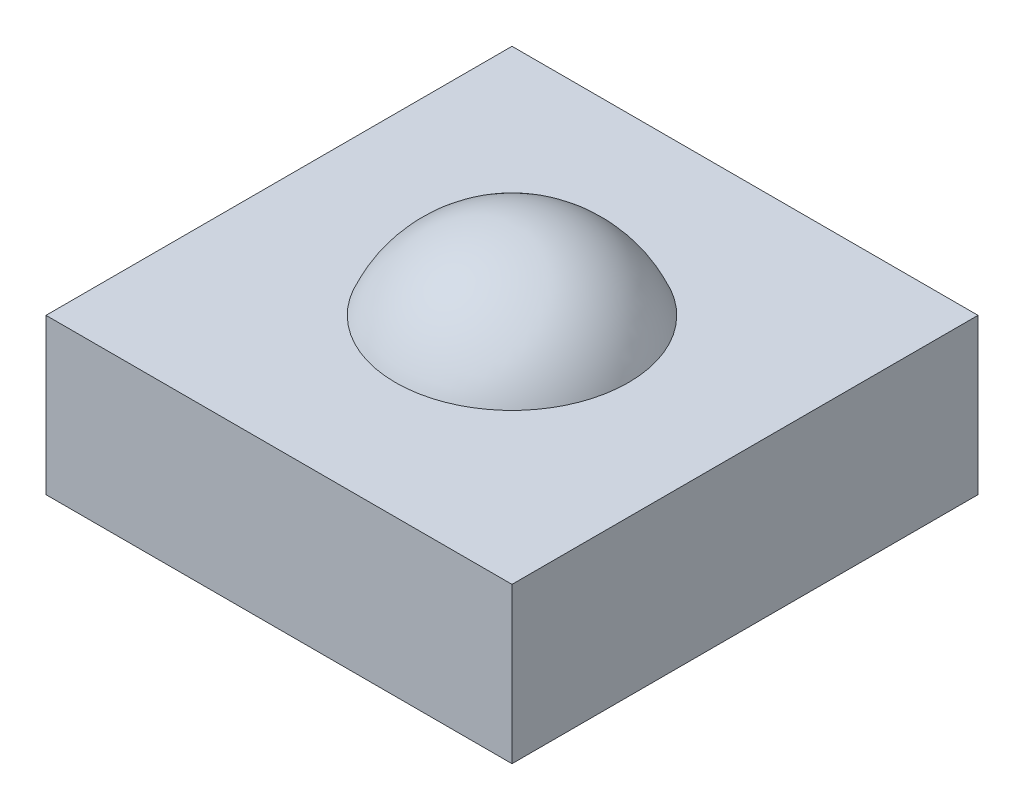
ISO-10303-21;
HEADER;
FILE_DESCRIPTION(('STEP AP214'),'2;1');
FILE_NAME('part.step','',(''),(''),'','','');
FILE_SCHEMA(('AUTOMOTIVE_DESIGN { 1 0 10303 214 1 1 1 1 }'));
ENDSEC;
DATA;
#1=APPLICATION_CONTEXT('core data for automotive mechanical design processes');
#2=APPLICATION_PROTOCOL_DEFINITION('international standard','automotive_design',2000,#1);
#3=PRODUCT_CONTEXT('',#1,'mechanical');
#4=PRODUCT('Part','Part','',(#3));
#5=PRODUCT_RELATED_PRODUCT_CATEGORY('part','',(#4));
#6=PRODUCT_DEFINITION_FORMATION('','',#4);
#7=PRODUCT_DEFINITION_CONTEXT('part definition',#1,'design');
#8=PRODUCT_DEFINITION('design','',#6,#7);
#9=PRODUCT_DEFINITION_SHAPE('','',#8);
#10=(LENGTH_UNIT() NAMED_UNIT(*) SI_UNIT(.MILLI.,.METRE.));
#11=(NAMED_UNIT(*) PLANE_ANGLE_UNIT() SI_UNIT($,.RADIAN.));
#12=(NAMED_UNIT(*) SI_UNIT($,.STERADIAN.) SOLID_ANGLE_UNIT());
#13=UNCERTAINTY_MEASURE_WITH_UNIT(LENGTH_MEASURE(1.E-05),#10,'distance_accuracy_value','');
#14=(GEOMETRIC_REPRESENTATION_CONTEXT(3) GLOBAL_UNCERTAINTY_ASSIGNED_CONTEXT((#13)) GLOBAL_UNIT_ASSIGNED_CONTEXT((#10,
#11,#12)) REPRESENTATION_CONTEXT('',''));
#15=CARTESIAN_POINT('',(0.,0.,0.));
#16=DIRECTION('',(0.,0.,1.));
#17=DIRECTION('',(1.,0.,0.));
#18=AXIS2_PLACEMENT_3D('',#15,#16,#17);
#19=CARTESIAN_POINT('',(0.3,0.2,-0.3));
#20=DIRECTION('',(-1.,0.,0.));
#21=DIRECTION('',(0.,0.,1.));
#22=AXIS2_PLACEMENT_3D('',#19,#20,#21);
#23=PLANE('',#22);
#24=DIRECTION('',(0.,0.,-1.));
#25=VECTOR('',#24,1.);
#26=CARTESIAN_POINT('',(0.3,0.,-0.3));
#27=LINE('',#26,#25);
#28=CARTESIAN_POINT('',(0.3,0.,0.3));
#29=VERTEX_POINT('',#28);
#30=CARTESIAN_POINT('',(0.3,0.,-0.3));
#31=VERTEX_POINT('',#30);
#32=EDGE_CURVE('E104',#29,#31,#27,.T.);
#33=ORIENTED_EDGE('',*,*,#32,.T.);
#34=DIRECTION('',(0.,-1.,0.));
#35=VECTOR('',#34,1.);
#36=CARTESIAN_POINT('',(0.3,0.2,-0.3));
#37=LINE('',#36,#35);
#38=CARTESIAN_POINT('',(0.3,0.2,-0.3));
#39=VERTEX_POINT('',#38);
#40=EDGE_CURVE('E46',#39,#31,#37,.T.);
#41=ORIENTED_EDGE('',*,*,#40,.F.);
#42=DIRECTION('',(0.,0.,-1.));
#43=VECTOR('',#42,1.);
#44=CARTESIAN_POINT('',(0.3,0.2,-0.3));
#45=LINE('',#44,#43);
#46=CARTESIAN_POINT('',(0.3,0.2,0.3));
#47=VERTEX_POINT('',#46);
#48=EDGE_CURVE('E90',#47,#39,#45,.T.);
#49=ORIENTED_EDGE('',*,*,#48,.F.);
#50=DIRECTION('',(0.,-1.,0.));
#51=VECTOR('',#50,1.);
#52=CARTESIAN_POINT('',(0.3,0.2,0.3));
#53=LINE('',#52,#51);
#54=EDGE_CURVE('E100',#47,#29,#53,.T.);
#55=ORIENTED_EDGE('',*,*,#54,.T.);
#56=EDGE_LOOP('',(#33,#41,#49,#55));
#57=FACE_BOUND('',#56,.T.);
#58=ADVANCED_FACE('F38',(#57),#23,.F.);
#59=CARTESIAN_POINT('',(-0.3,0.2,-0.3));
#60=DIRECTION('',(0.,0.,1.));
#61=DIRECTION('',(1.,0.,0.));
#62=AXIS2_PLACEMENT_3D('',#59,#60,#61);
#63=PLANE('',#62);
#64=DIRECTION('',(-1.,0.,0.));
#65=VECTOR('',#64,1.);
#66=CARTESIAN_POINT('',(-0.3,0.,-0.3));
#67=LINE('',#66,#65);
#68=CARTESIAN_POINT('',(-0.3,0.,-0.3));
#69=VERTEX_POINT('',#68);
#70=EDGE_CURVE('E95',#31,#69,#67,.T.);
#71=ORIENTED_EDGE('',*,*,#70,.T.);
#72=DIRECTION('',(0.,-1.,0.));
#73=VECTOR('',#72,1.);
#74=CARTESIAN_POINT('',(-0.3,0.2,-0.3));
#75=LINE('',#74,#73);
#76=CARTESIAN_POINT('',(-0.3,0.2,-0.3));
#77=VERTEX_POINT('',#76);
#78=EDGE_CURVE('E93',#77,#69,#75,.T.);
#79=ORIENTED_EDGE('',*,*,#78,.F.);
#80=DIRECTION('',(-1.,0.,0.));
#81=VECTOR('',#80,1.);
#82=CARTESIAN_POINT('',(-0.3,0.2,-0.3));
#83=LINE('',#82,#81);
#84=EDGE_CURVE('E85',#39,#77,#83,.T.);
#85=ORIENTED_EDGE('',*,*,#84,.F.);
#86=ORIENTED_EDGE('',*,*,#40,.T.);
#87=EDGE_LOOP('',(#71,#79,#85,#86));
#88=FACE_BOUND('',#87,.T.);
#89=ADVANCED_FACE('F94',(#88),#63,.F.);
#90=CARTESIAN_POINT('',(-0.3,0.2,-0.3));
#91=DIRECTION('',(1.,0.,0.));
#92=DIRECTION('',(0.,0.,-1.));
#93=AXIS2_PLACEMENT_3D('',#90,#91,#92);
#94=PLANE('',#93);
#95=DIRECTION('',(0.,0.,1.));
#96=VECTOR('',#95,1.);
#97=CARTESIAN_POINT('',(-0.3,0.,-0.3));
#98=LINE('',#97,#96);
#99=CARTESIAN_POINT('',(-0.3,0.,0.3));
#100=VERTEX_POINT('',#99);
#101=EDGE_CURVE('E71',#69,#100,#98,.T.);
#102=ORIENTED_EDGE('',*,*,#101,.T.);
#103=DIRECTION('',(0.,-1.,0.));
#104=VECTOR('',#103,1.);
#105=CARTESIAN_POINT('',(-0.3,0.2,0.3));
#106=LINE('',#105,#104);
#107=CARTESIAN_POINT('',(-0.3,0.2,0.3));
#108=VERTEX_POINT('',#107);
#109=EDGE_CURVE('E96',#108,#100,#106,.T.);
#110=ORIENTED_EDGE('',*,*,#109,.F.);
#111=DIRECTION('',(0.,0.,1.));
#112=VECTOR('',#111,1.);
#113=CARTESIAN_POINT('',(-0.3,0.2,-0.3));
#114=LINE('',#113,#112);
#115=EDGE_CURVE('E88',#77,#108,#114,.T.);
#116=ORIENTED_EDGE('',*,*,#115,.F.);
#117=ORIENTED_EDGE('',*,*,#78,.T.);
#118=EDGE_LOOP('',(#102,#110,#116,#117));
#119=FACE_BOUND('',#118,.T.);
#120=ADVANCED_FACE('F98',(#119),#94,.F.);
#121=CARTESIAN_POINT('',(-0.3,0.2,0.3));
#122=DIRECTION('',(0.,0.,-1.));
#123=DIRECTION('',(-1.,0.,0.));
#124=AXIS2_PLACEMENT_3D('',#121,#122,#123);
#125=PLANE('',#124);
#126=DIRECTION('',(1.,0.,0.));
#127=VECTOR('',#126,1.);
#128=CARTESIAN_POINT('',(-0.3,0.,0.3));
#129=LINE('',#128,#127);
#130=EDGE_CURVE('E77',#100,#29,#129,.T.);
#131=ORIENTED_EDGE('',*,*,#130,.T.);
#132=ORIENTED_EDGE('',*,*,#54,.F.);
#133=DIRECTION('',(1.,0.,0.));
#134=VECTOR('',#133,1.);
#135=CARTESIAN_POINT('',(-0.3,0.2,0.3));
#136=LINE('',#135,#134);
#137=EDGE_CURVE('E54',#108,#47,#136,.T.);
#138=ORIENTED_EDGE('',*,*,#137,.F.);
#139=ORIENTED_EDGE('',*,*,#109,.T.);
#140=EDGE_LOOP('',(#131,#132,#138,#139));
#141=FACE_BOUND('',#140,.T.);
#142=ADVANCED_FACE('F126',(#141),#125,.F.);
#143=CARTESIAN_POINT('',(0.,0.2,0.));
#144=DIRECTION('',(0.,1.,0.));
#145=DIRECTION('',(0.,0.,1.));
#146=AXIS2_PLACEMENT_3D('',#143,#144,#145);
#147=PLANE('',#146);
#148=CARTESIAN_POINT('',(0.,0.2,0.));
#149=DIRECTION('',(0.,1.,0.));
#150=DIRECTION('',(0.,0.,1.));
#151=AXIS2_PLACEMENT_3D('',#148,#149,#150);
#152=CIRCLE('',#151,0.15);
#153=CARTESIAN_POINT('',(0.,0.2,0.15));
#154=VERTEX_POINT('',#153);
#155=EDGE_CURVE('E12',#154,#154,#152,.T.);
#156=ORIENTED_EDGE('',*,*,#155,.F.);
#157=EDGE_LOOP('',(#156));
#158=FACE_BOUND('',#157,.T.);
#159=ORIENTED_EDGE('',*,*,#48,.T.);
#160=ORIENTED_EDGE('',*,*,#84,.T.);
#161=ORIENTED_EDGE('',*,*,#115,.T.);
#162=ORIENTED_EDGE('',*,*,#137,.T.);
#163=EDGE_LOOP('',(#159,#160,#161,#162));
#164=FACE_BOUND('',#163,.T.);
#165=ADVANCED_FACE('F86',(#158,#164),#147,.T.);
#166=CARTESIAN_POINT('',(0.,0.,0.));
#167=DIRECTION('',(0.,1.,0.));
#168=DIRECTION('',(0.,0.,1.));
#169=AXIS2_PLACEMENT_3D('',#166,#167,#168);
#170=PLANE('',#169);
#171=ORIENTED_EDGE('',*,*,#32,.F.);
#172=ORIENTED_EDGE('',*,*,#130,.F.);
#173=ORIENTED_EDGE('',*,*,#101,.F.);
#174=ORIENTED_EDGE('',*,*,#70,.F.);
#175=EDGE_LOOP('',(#171,#172,#173,#174));
#176=FACE_BOUND('',#175,.T.);
#177=ADVANCED_FACE('F114',(#176),#170,.F.);
#178=CARTESIAN_POINT('',(0.,0.1375,0.));
#179=DIRECTION('',(0.,-1.,0.));
#180=DIRECTION('',(1.,0.,0.));
#181=AXIS2_PLACEMENT_3D('',#178,#179,#180);
#182=SPHERICAL_SURFACE('',#181,0.1625);
#183=ORIENTED_EDGE('',*,*,#155,.T.);
#184=EDGE_LOOP('',(#183));
#185=FACE_BOUND('',#184,.T.);
#186=ADVANCED_FACE('F116',(#185),#182,.T.);
#187=CLOSED_SHELL('',(#58,#89,#120,#142,#165,#177,#186));
#188=MANIFOLD_SOLID_BREP('B2',#187);
#189=ADVANCED_BREP_SHAPE_REPRESENTATION('',(#18,#188),#14);
#190=SHAPE_DEFINITION_REPRESENTATION(#9,#189);
ENDSEC;
END-ISO-10303-21;
